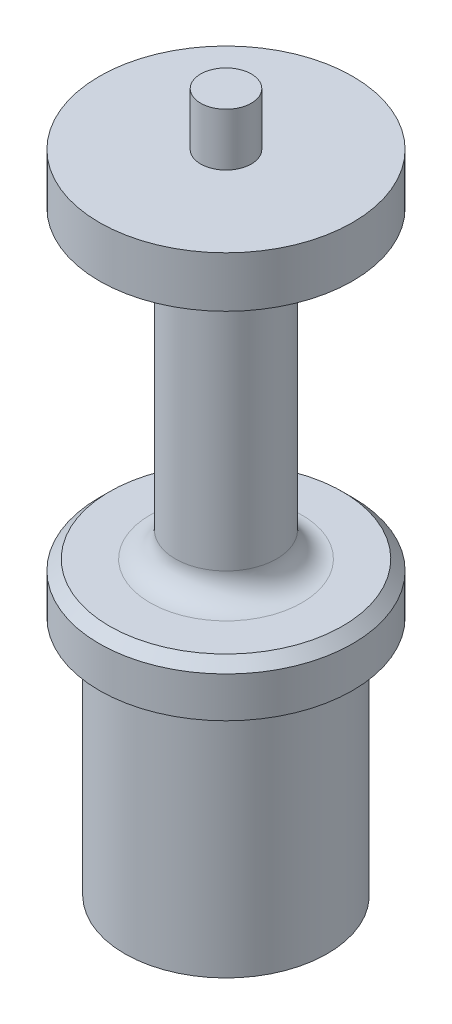
ISO-10303-21;
HEADER;
FILE_DESCRIPTION(('STEP AP214'),'2;1');
FILE_NAME('part.step','',(''),(''),'','','');
FILE_SCHEMA(('AUTOMOTIVE_DESIGN { 1 0 10303 214 1 1 1 1 }'));
ENDSEC;
DATA;
#1=APPLICATION_CONTEXT('core data for automotive mechanical design processes');
#2=APPLICATION_PROTOCOL_DEFINITION('international standard','automotive_design',2000,#1);
#3=PRODUCT_CONTEXT('',#1,'mechanical');
#4=PRODUCT('Part','Part','',(#3));
#5=PRODUCT_RELATED_PRODUCT_CATEGORY('part','',(#4));
#6=PRODUCT_DEFINITION_FORMATION('','',#4);
#7=PRODUCT_DEFINITION_CONTEXT('part definition',#1,'design');
#8=PRODUCT_DEFINITION('design','',#6,#7);
#9=PRODUCT_DEFINITION_SHAPE('','',#8);
#10=(LENGTH_UNIT() NAMED_UNIT(*) SI_UNIT(.MILLI.,.METRE.));
#11=(NAMED_UNIT(*) PLANE_ANGLE_UNIT() SI_UNIT($,.RADIAN.));
#12=(NAMED_UNIT(*) SI_UNIT($,.STERADIAN.) SOLID_ANGLE_UNIT());
#13=UNCERTAINTY_MEASURE_WITH_UNIT(LENGTH_MEASURE(1.E-05),#10,'distance_accuracy_value','');
#14=(GEOMETRIC_REPRESENTATION_CONTEXT(3) GLOBAL_UNCERTAINTY_ASSIGNED_CONTEXT((#13)) GLOBAL_UNIT_ASSIGNED_CONTEXT((#10,
#11,#12)) REPRESENTATION_CONTEXT('',''));
#15=CARTESIAN_POINT('',(0.,0.,0.));
#16=DIRECTION('',(0.,0.,1.));
#17=DIRECTION('',(1.,0.,0.));
#18=AXIS2_PLACEMENT_3D('',#15,#16,#17);
#19=CARTESIAN_POINT('',(0.,80.9625,0.));
#20=DIRECTION('',(0.,-1.,0.));
#21=DIRECTION('',(0.,0.,-1.));
#22=AXIS2_PLACEMENT_3D('',#19,#20,#21);
#23=CYLINDRICAL_SURFACE('',#22,15.875);
#24=CARTESIAN_POINT('',(0.,35.2425,0.));
#25=DIRECTION('',(0.,1.,0.));
#26=DIRECTION('',(0.,0.,1.));
#27=AXIS2_PLACEMENT_3D('',#24,#25,#26);
#28=CIRCLE('',#27,15.875);
#29=CARTESIAN_POINT('',(0.,35.2425,15.875));
#30=VERTEX_POINT('',#29);
#31=EDGE_CURVE('E11',#30,#30,#28,.F.);
#32=ORIENTED_EDGE('',*,*,#31,.T.);
#33=EDGE_LOOP('',(#32));
#34=FACE_BOUND('',#33,.T.);
#35=CARTESIAN_POINT('',(0.,30.1625,0.));
#36=DIRECTION('',(0.,1.,0.));
#37=DIRECTION('',(0.,0.,1.));
#38=AXIS2_PLACEMENT_3D('',#35,#36,#37);
#39=CIRCLE('',#38,15.875);
#40=CARTESIAN_POINT('',(0.,30.1625,15.875));
#41=VERTEX_POINT('',#40);
#42=EDGE_CURVE('E297',#41,#41,#39,.T.);
#43=ORIENTED_EDGE('',*,*,#42,.T.);
#44=EDGE_LOOP('',(#43));
#45=FACE_BOUND('',#44,.T.);
#46=ADVANCED_FACE('F35',(#34,#45),#23,.T.);
#47=CARTESIAN_POINT('',(0.,0.,0.));
#48=DIRECTION('',(0.,1.,0.));
#49=DIRECTION('',(0.,0.,1.));
#50=AXIS2_PLACEMENT_3D('',#47,#48,#49);
#51=PLANE('',#50);
#52=CARTESIAN_POINT('',(0.,0.,0.));
#53=DIRECTION('',(0.,1.,0.));
#54=DIRECTION('',(0.,0.,1.));
#55=AXIS2_PLACEMENT_3D('',#52,#53,#54);
#56=CIRCLE('',#55,12.7);
#57=CARTESIAN_POINT('',(0.,0.,12.7));
#58=VERTEX_POINT('',#57);
#59=EDGE_CURVE('E342',#58,#58,#56,.T.);
#60=ORIENTED_EDGE('',*,*,#59,.F.);
#61=EDGE_LOOP('',(#60));
#62=FACE_BOUND('',#61,.T.);
#63=DIRECTION('',(0.707106781186548,0.,0.707106781186547));
#64=VECTOR('',#63,1.);
#65=CARTESIAN_POINT('',(-4.94974746830584,0.,4.94974746830584));
#66=LINE('',#65,#64);
#67=CARTESIAN_POINT('',(-8.77696292147802,0.,1.12253201513365));
#68=VERTEX_POINT('',#67);
#69=CARTESIAN_POINT('',(-7.,0.,2.89949493661167));
#70=VERTEX_POINT('',#69);
#71=EDGE_CURVE('E50',#68,#70,#66,.T.);
#72=ORIENTED_EDGE('',*,*,#71,.T.);
#73=DIRECTION('',(0.,0.,1.));
#74=VECTOR('',#73,1.);
#75=CARTESIAN_POINT('',(-7.,0.,0.));
#76=LINE('',#75,#74);
#77=CARTESIAN_POINT('',(-7.,0.,5.4125));
#78=VERTEX_POINT('',#77);
#79=EDGE_CURVE('E136',#70,#78,#76,.T.);
#80=ORIENTED_EDGE('',*,*,#79,.T.);
#81=CARTESIAN_POINT('',(-5.4125,0.,5.4125));
#82=DIRECTION('',(0.,-1.,0.));
#83=DIRECTION('',(0.,0.,-1.));
#84=AXIS2_PLACEMENT_3D('',#81,#82,#83);
#85=CIRCLE('',#84,1.5875);
#86=CARTESIAN_POINT('',(-5.4125,0.,7.));
#87=VERTEX_POINT('',#86);
#88=EDGE_CURVE('E291',#87,#78,#85,.T.);
#89=ORIENTED_EDGE('',*,*,#88,.F.);
#90=DIRECTION('',(1.,0.,0.));
#91=VECTOR('',#90,1.);
#92=CARTESIAN_POINT('',(0.,0.,7.));
#93=LINE('',#92,#91);
#94=CARTESIAN_POINT('',(-2.89949493661167,0.,7.));
#95=VERTEX_POINT('',#94);
#96=EDGE_CURVE('E208',#87,#95,#93,.T.);
#97=ORIENTED_EDGE('',*,*,#96,.T.);
#98=DIRECTION('',(0.707106781186548,0.,0.707106781186547));
#99=VECTOR('',#98,1.);
#100=CARTESIAN_POINT('',(-4.94974746830584,0.,4.94974746830584));
#101=LINE('',#100,#99);
#102=CARTESIAN_POINT('',(-1.12253201513365,0.,8.77696292147802));
#103=VERTEX_POINT('',#102);
#104=EDGE_CURVE('E287',#95,#103,#101,.T.);
#105=ORIENTED_EDGE('',*,*,#104,.T.);
#106=CARTESIAN_POINT('',(0.,0.,7.65443090634438));
#107=DIRECTION('',(0.,-1.,0.));
#108=DIRECTION('',(0.,0.,-1.));
#109=AXIS2_PLACEMENT_3D('',#106,#107,#108);
#110=CIRCLE('',#109,1.5875);
#111=CARTESIAN_POINT('',(1.12253201513365,0.,8.77696292147801));
#112=VERTEX_POINT('',#111);
#113=EDGE_CURVE('E284',#112,#103,#110,.T.);
#114=ORIENTED_EDGE('',*,*,#113,.F.);
#115=DIRECTION('',(0.707106781186548,0.,-0.707106781186548));
#116=VECTOR('',#115,1.);
#117=CARTESIAN_POINT('',(4.94974746830583,0.,4.94974746830583));
#118=LINE('',#117,#116);
#119=CARTESIAN_POINT('',(2.89949493661166,0.,7.));
#120=VERTEX_POINT('',#119);
#121=EDGE_CURVE('E281',#112,#120,#118,.T.);
#122=ORIENTED_EDGE('',*,*,#121,.T.);
#123=DIRECTION('',(1.,0.,0.));
#124=VECTOR('',#123,1.);
#125=CARTESIAN_POINT('',(0.,0.,7.));
#126=LINE('',#125,#124);
#127=CARTESIAN_POINT('',(5.4125,0.,7.));
#128=VERTEX_POINT('',#127);
#129=EDGE_CURVE('E278',#120,#128,#126,.T.);
#130=ORIENTED_EDGE('',*,*,#129,.T.);
#131=CARTESIAN_POINT('',(5.4125,0.,5.4125));
#132=DIRECTION('',(0.,-1.,0.));
#133=DIRECTION('',(0.,0.,-1.));
#134=AXIS2_PLACEMENT_3D('',#131,#132,#133);
#135=CIRCLE('',#134,1.5875);
#136=CARTESIAN_POINT('',(7.,0.,5.4125));
#137=VERTEX_POINT('',#136);
#138=EDGE_CURVE('E275',#137,#128,#135,.T.);
#139=ORIENTED_EDGE('',*,*,#138,.F.);
#140=DIRECTION('',(0.,0.,1.));
#141=VECTOR('',#140,1.);
#142=CARTESIAN_POINT('',(7.,0.,0.));
#143=LINE('',#142,#141);
#144=CARTESIAN_POINT('',(7.,0.,2.89949493661167));
#145=VERTEX_POINT('',#144);
#146=EDGE_CURVE('E272',#145,#137,#143,.T.);
#147=ORIENTED_EDGE('',*,*,#146,.F.);
#148=DIRECTION('',(0.707106781186548,0.,-0.707106781186548));
#149=VECTOR('',#148,1.);
#150=CARTESIAN_POINT('',(4.94974746830583,0.,4.94974746830583));
#151=LINE('',#150,#149);
#152=CARTESIAN_POINT('',(8.77696292147802,0.,1.12253201513365));
#153=VERTEX_POINT('',#152);
#154=EDGE_CURVE('E269',#145,#153,#151,.T.);
#155=ORIENTED_EDGE('',*,*,#154,.T.);
#156=CARTESIAN_POINT('',(7.65443090634438,0.,0.));
#157=DIRECTION('',(0.,-1.,0.));
#158=DIRECTION('',(0.,0.,-1.));
#159=AXIS2_PLACEMENT_3D('',#156,#157,#158);
#160=CIRCLE('',#159,1.5875);
#161=CARTESIAN_POINT('',(8.77696292147801,0.,-1.12253201513364));
#162=VERTEX_POINT('',#161);
#163=EDGE_CURVE('E266',#162,#153,#160,.T.);
#164=ORIENTED_EDGE('',*,*,#163,.F.);
#165=DIRECTION('',(0.707106781186548,0.,0.707106781186548));
#166=VECTOR('',#165,1.);
#167=CARTESIAN_POINT('',(4.94974746830583,0.,-4.94974746830583));
#168=LINE('',#167,#166);
#169=CARTESIAN_POINT('',(7.,0.,-2.89949493661165));
#170=VERTEX_POINT('',#169);
#171=EDGE_CURVE('E263',#170,#162,#168,.T.);
#172=ORIENTED_EDGE('',*,*,#171,.F.);
#173=DIRECTION('',(0.,0.,1.));
#174=VECTOR('',#173,1.);
#175=CARTESIAN_POINT('',(7.,0.,0.));
#176=LINE('',#175,#174);
#177=CARTESIAN_POINT('',(7.,0.,-5.4125));
#178=VERTEX_POINT('',#177);
#179=EDGE_CURVE('E260',#178,#170,#176,.T.);
#180=ORIENTED_EDGE('',*,*,#179,.F.);
#181=CARTESIAN_POINT('',(5.4125,0.,-5.4125));
#182=DIRECTION('',(0.,-1.,0.));
#183=DIRECTION('',(0.,0.,-1.));
#184=AXIS2_PLACEMENT_3D('',#181,#182,#183);
#185=CIRCLE('',#184,1.5875);
#186=CARTESIAN_POINT('',(5.4125,0.,-7.));
#187=VERTEX_POINT('',#186);
#188=EDGE_CURVE('E257',#187,#178,#185,.T.);
#189=ORIENTED_EDGE('',*,*,#188,.F.);
#190=DIRECTION('',(1.,0.,0.));
#191=VECTOR('',#190,1.);
#192=CARTESIAN_POINT('',(0.,0.,-7.));
#193=LINE('',#192,#191);
#194=CARTESIAN_POINT('',(2.89949493661166,0.,-7.));
#195=VERTEX_POINT('',#194);
#196=EDGE_CURVE('E254',#195,#187,#193,.T.);
#197=ORIENTED_EDGE('',*,*,#196,.F.);
#198=DIRECTION('',(0.707106781186548,0.,0.707106781186548));
#199=VECTOR('',#198,1.);
#200=CARTESIAN_POINT('',(4.94974746830583,0.,-4.94974746830583));
#201=LINE('',#200,#199);
#202=CARTESIAN_POINT('',(1.12253201513364,0.,-8.77696292147802));
#203=VERTEX_POINT('',#202);
#204=EDGE_CURVE('E251',#203,#195,#201,.T.);
#205=ORIENTED_EDGE('',*,*,#204,.F.);
#206=CARTESIAN_POINT('',(0.,0.,-7.65443090634438));
#207=DIRECTION('',(0.,-1.,0.));
#208=DIRECTION('',(0.,0.,-1.));
#209=AXIS2_PLACEMENT_3D('',#206,#207,#208);
#210=CIRCLE('',#209,1.5875);
#211=CARTESIAN_POINT('',(-1.12253201513365,0.,-8.77696292147802));
#212=VERTEX_POINT('',#211);
#213=EDGE_CURVE('E248',#212,#203,#210,.T.);
#214=ORIENTED_EDGE('',*,*,#213,.F.);
#215=DIRECTION('',(0.707106781186547,0.,-0.707106781186548));
#216=VECTOR('',#215,1.);
#217=CARTESIAN_POINT('',(-4.94974746830583,0.,-4.94974746830583));
#218=LINE('',#217,#216);
#219=CARTESIAN_POINT('',(-2.89949493661167,0.,-7.));
#220=VERTEX_POINT('',#219);
#221=EDGE_CURVE('E245',#220,#212,#218,.T.);
#222=ORIENTED_EDGE('',*,*,#221,.F.);
#223=DIRECTION('',(1.,0.,0.));
#224=VECTOR('',#223,1.);
#225=CARTESIAN_POINT('',(0.,0.,-7.));
#226=LINE('',#225,#224);
#227=CARTESIAN_POINT('',(-5.4125,0.,-7.));
#228=VERTEX_POINT('',#227);
#229=EDGE_CURVE('E242',#228,#220,#226,.T.);
#230=ORIENTED_EDGE('',*,*,#229,.F.);
#231=CARTESIAN_POINT('',(-5.4125,0.,-5.4125));
#232=DIRECTION('',(0.,-1.,0.));
#233=DIRECTION('',(0.,0.,-1.));
#234=AXIS2_PLACEMENT_3D('',#231,#232,#233);
#235=CIRCLE('',#234,1.5875);
#236=CARTESIAN_POINT('',(-7.,0.,-5.4125));
#237=VERTEX_POINT('',#236);
#238=EDGE_CURVE('E239',#237,#228,#235,.T.);
#239=ORIENTED_EDGE('',*,*,#238,.F.);
#240=DIRECTION('',(0.,0.,1.));
#241=VECTOR('',#240,1.);
#242=CARTESIAN_POINT('',(-7.,0.,0.));
#243=LINE('',#242,#241);
#244=CARTESIAN_POINT('',(-7.,0.,-2.89949493661167));
#245=VERTEX_POINT('',#244);
#246=EDGE_CURVE('E236',#237,#245,#243,.T.);
#247=ORIENTED_EDGE('',*,*,#246,.T.);
#248=DIRECTION('',(0.707106781186547,0.,-0.707106781186548));
#249=VECTOR('',#248,1.);
#250=CARTESIAN_POINT('',(-4.94974746830583,0.,-4.94974746830583));
#251=LINE('',#250,#249);
#252=CARTESIAN_POINT('',(-8.77696292147803,0.,-1.12253201513364));
#253=VERTEX_POINT('',#252);
#254=EDGE_CURVE('E233',#253,#245,#251,.T.);
#255=ORIENTED_EDGE('',*,*,#254,.F.);
#256=CARTESIAN_POINT('',(-7.65443090634438,0.,0.));
#257=DIRECTION('',(0.,-1.,0.));
#258=DIRECTION('',(0.,0.,-1.));
#259=AXIS2_PLACEMENT_3D('',#256,#257,#258);
#260=CIRCLE('',#259,1.5875);
#261=EDGE_CURVE('E229',#68,#253,#260,.T.);
#262=ORIENTED_EDGE('',*,*,#261,.F.);
#263=EDGE_LOOP('',(#72,#80,#89,#97,#105,#114,#122,#130,#139,#147,#155,#164,#172,#180,#189,#197,
#205,#214,#222,#230,#239,#247,#255,#262));
#264=FACE_BOUND('',#263,.T.);
#265=ADVANCED_FACE('F378',(#62,#264),#51,.F.);
#266=CARTESIAN_POINT('',(0.,30.1625,0.));
#267=DIRECTION('',(0.,-1.,0.));
#268=DIRECTION('',(0.,0.,-1.));
#269=AXIS2_PLACEMENT_3D('',#266,#267,#268);
#270=CYLINDRICAL_SURFACE('',#269,12.7);
#271=CARTESIAN_POINT('',(0.,30.1625,0.));
#272=DIRECTION('',(0.,1.,0.));
#273=DIRECTION('',(0.,0.,1.));
#274=AXIS2_PLACEMENT_3D('',#271,#272,#273);
#275=CIRCLE('',#274,12.7);
#276=CARTESIAN_POINT('',(0.,30.1625,12.7));
#277=VERTEX_POINT('',#276);
#278=EDGE_CURVE('E345',#277,#277,#275,.T.);
#279=ORIENTED_EDGE('',*,*,#278,.F.);
#280=EDGE_LOOP('',(#279));
#281=FACE_BOUND('',#280,.T.);
#282=ORIENTED_EDGE('',*,*,#59,.T.);
#283=EDGE_LOOP('',(#282));
#284=FACE_BOUND('',#283,.T.);
#285=ADVANCED_FACE('F385',(#281,#284),#270,.T.);
#286=CARTESIAN_POINT('',(0.,30.1625,0.));
#287=DIRECTION('',(0.,1.,0.));
#288=DIRECTION('',(0.,0.,1.));
#289=AXIS2_PLACEMENT_3D('',#286,#287,#288);
#290=PLANE('',#289);
#291=ORIENTED_EDGE('',*,*,#278,.T.);
#292=EDGE_LOOP('',(#291));
#293=FACE_BOUND('',#292,.T.);
#294=ORIENTED_EDGE('',*,*,#42,.F.);
#295=EDGE_LOOP('',(#294));
#296=FACE_BOUND('',#295,.T.);
#297=ADVANCED_FACE('F509',(#293,#296),#290,.F.);
#298=CARTESIAN_POINT('',(-4.94974746830584,11.176,4.94974746830584));
#299=DIRECTION('',(0.707106781186548,0.,-0.707106781186548));
#300=DIRECTION('',(-0.707106781186548,0.,-0.707106781186547));
#301=AXIS2_PLACEMENT_3D('',#298,#299,#300);
#302=PLANE('',#301);
#303=ORIENTED_EDGE('',*,*,#71,.F.);
#304=DIRECTION('',(0.,-1.,0.));
#305=VECTOR('',#304,1.);
#306=CARTESIAN_POINT('',(-8.77696292147802,11.176,1.12253201513365));
#307=LINE('',#306,#305);
#308=CARTESIAN_POINT('',(-8.77696292147802,11.176,1.12253201513365));
#309=VERTEX_POINT('',#308);
#310=EDGE_CURVE('E139',#309,#68,#307,.T.);
#311=ORIENTED_EDGE('',*,*,#310,.F.);
#312=DIRECTION('',(0.707106781186548,0.,0.707106781186547));
#313=VECTOR('',#312,1.);
#314=CARTESIAN_POINT('',(-4.94974746830584,11.176,4.94974746830584));
#315=LINE('',#314,#313);
#316=CARTESIAN_POINT('',(-7.,11.176,2.89949493661167));
#317=VERTEX_POINT('',#316);
#318=EDGE_CURVE('E294',#309,#317,#315,.T.);
#319=ORIENTED_EDGE('',*,*,#318,.T.);
#320=DIRECTION('',(0.,-1.,0.));
#321=VECTOR('',#320,1.);
#322=CARTESIAN_POINT('',(-7.,11.176,2.89949493661167));
#323=LINE('',#322,#321);
#324=EDGE_CURVE('E295',#317,#70,#323,.T.);
#325=ORIENTED_EDGE('',*,*,#324,.T.);
#326=EDGE_LOOP('',(#303,#311,#319,#325));
#327=FACE_BOUND('',#326,.T.);
#328=ADVANCED_FACE('F500',(#327),#302,.T.);
#329=CARTESIAN_POINT('',(-7.,11.176,0.));
#330=DIRECTION('',(1.,0.,0.));
#331=DIRECTION('',(0.,0.,-1.));
#332=AXIS2_PLACEMENT_3D('',#329,#330,#331);
#333=PLANE('',#332);
#334=ORIENTED_EDGE('',*,*,#79,.F.);
#335=ORIENTED_EDGE('',*,*,#324,.F.);
#336=DIRECTION('',(0.,0.,1.));
#337=VECTOR('',#336,1.);
#338=CARTESIAN_POINT('',(-7.,11.176,0.));
#339=LINE('',#338,#337);
#340=CARTESIAN_POINT('',(-7.,11.176,5.4125));
#341=VERTEX_POINT('',#340);
#342=EDGE_CURVE('E59',#317,#341,#339,.T.);
#343=ORIENTED_EDGE('',*,*,#342,.T.);
#344=DIRECTION('',(0.,-1.,0.));
#345=VECTOR('',#344,1.);
#346=CARTESIAN_POINT('',(-7.,11.176,5.4125));
#347=LINE('',#346,#345);
#348=EDGE_CURVE('E213',#341,#78,#347,.T.);
#349=ORIENTED_EDGE('',*,*,#348,.T.);
#350=EDGE_LOOP('',(#334,#335,#343,#349));
#351=FACE_BOUND('',#350,.T.);
#352=ADVANCED_FACE('F501',(#351),#333,.T.);
#353=CARTESIAN_POINT('',(-5.4125,11.176,5.4125));
#354=DIRECTION('',(0.,-1.,0.));
#355=DIRECTION('',(0.,0.,-1.));
#356=AXIS2_PLACEMENT_3D('',#353,#354,#355);
#357=CYLINDRICAL_SURFACE('',#356,1.5875);
#358=ORIENTED_EDGE('',*,*,#88,.T.);
#359=ORIENTED_EDGE('',*,*,#348,.F.);
#360=CARTESIAN_POINT('',(-5.4125,11.176,5.4125));
#361=DIRECTION('',(0.,-1.,0.));
#362=DIRECTION('',(0.,0.,-1.));
#363=AXIS2_PLACEMENT_3D('',#360,#361,#362);
#364=CIRCLE('',#363,1.5875);
#365=CARTESIAN_POINT('',(-5.4125,11.176,7.));
#366=VERTEX_POINT('',#365);
#367=EDGE_CURVE('E218',#366,#341,#364,.T.);
#368=ORIENTED_EDGE('',*,*,#367,.F.);
#369=DIRECTION('',(0.,-1.,0.));
#370=VECTOR('',#369,1.);
#371=CARTESIAN_POINT('',(-5.4125,11.176,7.));
#372=LINE('',#371,#370);
#373=EDGE_CURVE('E202',#366,#87,#372,.T.);
#374=ORIENTED_EDGE('',*,*,#373,.T.);
#375=EDGE_LOOP('',(#358,#359,#368,#374));
#376=FACE_BOUND('',#375,.T.);
#377=ADVANCED_FACE('F223',(#376),#357,.F.);
#378=CARTESIAN_POINT('',(0.,11.176,7.));
#379=DIRECTION('',(0.,0.,-1.));
#380=DIRECTION('',(-1.,0.,0.));
#381=AXIS2_PLACEMENT_3D('',#378,#379,#380);
#382=PLANE('',#381);
#383=ORIENTED_EDGE('',*,*,#96,.F.);
#384=ORIENTED_EDGE('',*,*,#373,.F.);
#385=DIRECTION('',(1.,0.,0.));
#386=VECTOR('',#385,1.);
#387=CARTESIAN_POINT('',(0.,11.176,7.));
#388=LINE('',#387,#386);
#389=CARTESIAN_POINT('',(-2.89949493661167,11.176,7.));
#390=VERTEX_POINT('',#389);
#391=EDGE_CURVE('E205',#366,#390,#388,.T.);
#392=ORIENTED_EDGE('',*,*,#391,.T.);
#393=DIRECTION('',(0.,-1.,0.));
#394=VECTOR('',#393,1.);
#395=CARTESIAN_POINT('',(-2.89949493661167,11.176,7.));
#396=LINE('',#395,#394);
#397=EDGE_CURVE('E214',#390,#95,#396,.T.);
#398=ORIENTED_EDGE('',*,*,#397,.T.);
#399=EDGE_LOOP('',(#383,#384,#392,#398));
#400=FACE_BOUND('',#399,.T.);
#401=ADVANCED_FACE('F204',(#400),#382,.T.);
#402=CARTESIAN_POINT('',(-4.94974746830584,11.176,4.94974746830584));
#403=DIRECTION('',(0.707106781186548,0.,-0.707106781186548));
#404=DIRECTION('',(-0.707106781186548,0.,-0.707106781186547));
#405=AXIS2_PLACEMENT_3D('',#402,#403,#404);
#406=PLANE('',#405);
#407=ORIENTED_EDGE('',*,*,#104,.F.);
#408=ORIENTED_EDGE('',*,*,#397,.F.);
#409=DIRECTION('',(0.707106781186548,0.,0.707106781186547));
#410=VECTOR('',#409,1.);
#411=CARTESIAN_POINT('',(-4.94974746830584,11.176,4.94974746830584));
#412=LINE('',#411,#410);
#413=CARTESIAN_POINT('',(-1.12253201513365,11.176,8.77696292147802));
#414=VERTEX_POINT('',#413);
#415=EDGE_CURVE('E220',#390,#414,#412,.T.);
#416=ORIENTED_EDGE('',*,*,#415,.T.);
#417=DIRECTION('',(0.,-1.,0.));
#418=VECTOR('',#417,1.);
#419=CARTESIAN_POINT('',(-1.12253201513365,11.176,8.77696292147802));
#420=LINE('',#419,#418);
#421=EDGE_CURVE('E300',#414,#103,#420,.T.);
#422=ORIENTED_EDGE('',*,*,#421,.T.);
#423=EDGE_LOOP('',(#407,#408,#416,#422));
#424=FACE_BOUND('',#423,.T.);
#425=ADVANCED_FACE('F476',(#424),#406,.T.);
#426=CARTESIAN_POINT('',(0.,11.176,7.65443090634438));
#427=DIRECTION('',(0.,-1.,0.));
#428=DIRECTION('',(0.,0.,-1.));
#429=AXIS2_PLACEMENT_3D('',#426,#427,#428);
#430=CYLINDRICAL_SURFACE('',#429,1.5875);
#431=ORIENTED_EDGE('',*,*,#113,.T.);
#432=ORIENTED_EDGE('',*,*,#421,.F.);
#433=CARTESIAN_POINT('',(0.,11.176,7.65443090634438));
#434=DIRECTION('',(0.,-1.,0.));
#435=DIRECTION('',(0.,0.,-1.));
#436=AXIS2_PLACEMENT_3D('',#433,#434,#435);
#437=CIRCLE('',#436,1.5875);
#438=CARTESIAN_POINT('',(1.12253201513365,11.176,8.77696292147801));
#439=VERTEX_POINT('',#438);
#440=EDGE_CURVE('E472',#439,#414,#437,.T.);
#441=ORIENTED_EDGE('',*,*,#440,.F.);
#442=DIRECTION('',(0.,-1.,0.));
#443=VECTOR('',#442,1.);
#444=CARTESIAN_POINT('',(1.12253201513365,11.176,8.77696292147801));
#445=LINE('',#444,#443);
#446=EDGE_CURVE('E302',#439,#112,#445,.T.);
#447=ORIENTED_EDGE('',*,*,#446,.T.);
#448=EDGE_LOOP('',(#431,#432,#441,#447));
#449=FACE_BOUND('',#448,.T.);
#450=ADVANCED_FACE('F479',(#449),#430,.F.);
#451=CARTESIAN_POINT('',(4.94974746830583,11.176,4.94974746830583));
#452=DIRECTION('',(-0.707106781186548,0.,-0.707106781186548));
#453=DIRECTION('',(-0.707106781186548,0.,0.707106781186548));
#454=AXIS2_PLACEMENT_3D('',#451,#452,#453);
#455=PLANE('',#454);
#456=ORIENTED_EDGE('',*,*,#121,.F.);
#457=ORIENTED_EDGE('',*,*,#446,.F.);
#458=DIRECTION('',(0.707106781186548,0.,-0.707106781186548));
#459=VECTOR('',#458,1.);
#460=CARTESIAN_POINT('',(4.94974746830583,11.176,4.94974746830583));
#461=LINE('',#460,#459);
#462=CARTESIAN_POINT('',(2.89949493661166,11.176,7.));
#463=VERTEX_POINT('',#462);
#464=EDGE_CURVE('E470',#439,#463,#461,.T.);
#465=ORIENTED_EDGE('',*,*,#464,.T.);
#466=DIRECTION('',(0.,-1.,0.));
#467=VECTOR('',#466,1.);
#468=CARTESIAN_POINT('',(2.89949493661166,11.176,7.));
#469=LINE('',#468,#467);
#470=EDGE_CURVE('E304',#463,#120,#469,.T.);
#471=ORIENTED_EDGE('',*,*,#470,.T.);
#472=EDGE_LOOP('',(#456,#457,#465,#471));
#473=FACE_BOUND('',#472,.T.);
#474=ADVANCED_FACE('F486',(#473),#455,.T.);
#475=CARTESIAN_POINT('',(0.,11.176,7.));
#476=DIRECTION('',(0.,0.,-1.));
#477=DIRECTION('',(-1.,0.,0.));
#478=AXIS2_PLACEMENT_3D('',#475,#476,#477);
#479=PLANE('',#478);
#480=ORIENTED_EDGE('',*,*,#129,.F.);
#481=ORIENTED_EDGE('',*,*,#470,.F.);
#482=DIRECTION('',(1.,0.,0.));
#483=VECTOR('',#482,1.);
#484=CARTESIAN_POINT('',(0.,11.176,7.));
#485=LINE('',#484,#483);
#486=CARTESIAN_POINT('',(5.4125,11.176,7.));
#487=VERTEX_POINT('',#486);
#488=EDGE_CURVE('E468',#463,#487,#485,.T.);
#489=ORIENTED_EDGE('',*,*,#488,.T.);
#490=DIRECTION('',(0.,-1.,0.));
#491=VECTOR('',#490,1.);
#492=CARTESIAN_POINT('',(5.4125,11.176,7.));
#493=LINE('',#492,#491);
#494=EDGE_CURVE('E306',#487,#128,#493,.T.);
#495=ORIENTED_EDGE('',*,*,#494,.T.);
#496=EDGE_LOOP('',(#480,#481,#489,#495));
#497=FACE_BOUND('',#496,.T.);
#498=ADVANCED_FACE('F489',(#497),#479,.T.);
#499=CARTESIAN_POINT('',(5.4125,11.176,5.4125));
#500=DIRECTION('',(0.,-1.,0.));
#501=DIRECTION('',(0.,0.,-1.));
#502=AXIS2_PLACEMENT_3D('',#499,#500,#501);
#503=CYLINDRICAL_SURFACE('',#502,1.5875);
#504=ORIENTED_EDGE('',*,*,#138,.T.);
#505=ORIENTED_EDGE('',*,*,#494,.F.);
#506=CARTESIAN_POINT('',(5.4125,11.176,5.4125));
#507=DIRECTION('',(0.,-1.,0.));
#508=DIRECTION('',(0.,0.,-1.));
#509=AXIS2_PLACEMENT_3D('',#506,#507,#508);
#510=CIRCLE('',#509,1.5875);
#511=CARTESIAN_POINT('',(7.,11.176,5.4125));
#512=VERTEX_POINT('',#511);
#513=EDGE_CURVE('E465',#512,#487,#510,.T.);
#514=ORIENTED_EDGE('',*,*,#513,.F.);
#515=DIRECTION('',(0.,-1.,0.));
#516=VECTOR('',#515,1.);
#517=CARTESIAN_POINT('',(7.,11.176,5.4125));
#518=LINE('',#517,#516);
#519=EDGE_CURVE('E308',#512,#137,#518,.T.);
#520=ORIENTED_EDGE('',*,*,#519,.T.);
#521=EDGE_LOOP('',(#504,#505,#514,#520));
#522=FACE_BOUND('',#521,.T.);
#523=ADVANCED_FACE('F524',(#522),#503,.F.);
#524=CARTESIAN_POINT('',(7.,11.176,0.));
#525=DIRECTION('',(1.,0.,0.));
#526=DIRECTION('',(0.,0.,-1.));
#527=AXIS2_PLACEMENT_3D('',#524,#525,#526);
#528=PLANE('',#527);
#529=ORIENTED_EDGE('',*,*,#146,.T.);
#530=ORIENTED_EDGE('',*,*,#519,.F.);
#531=DIRECTION('',(0.,0.,1.));
#532=VECTOR('',#531,1.);
#533=CARTESIAN_POINT('',(7.,11.176,0.));
#534=LINE('',#533,#532);
#535=CARTESIAN_POINT('',(7.,11.176,2.89949493661167));
#536=VERTEX_POINT('',#535);
#537=EDGE_CURVE('E462',#536,#512,#534,.T.);
#538=ORIENTED_EDGE('',*,*,#537,.F.);
#539=DIRECTION('',(0.,-1.,0.));
#540=VECTOR('',#539,1.);
#541=CARTESIAN_POINT('',(7.,11.176,2.89949493661167));
#542=LINE('',#541,#540);
#543=EDGE_CURVE('E310',#536,#145,#542,.T.);
#544=ORIENTED_EDGE('',*,*,#543,.T.);
#545=EDGE_LOOP('',(#529,#530,#538,#544));
#546=FACE_BOUND('',#545,.T.);
#547=ADVANCED_FACE('F527',(#546),#528,.F.);
#548=CARTESIAN_POINT('',(4.94974746830583,11.176,4.94974746830583));
#549=DIRECTION('',(-0.707106781186548,0.,-0.707106781186548));
#550=DIRECTION('',(-0.707106781186548,0.,0.707106781186548));
#551=AXIS2_PLACEMENT_3D('',#548,#549,#550);
#552=PLANE('',#551);
#553=ORIENTED_EDGE('',*,*,#154,.F.);
#554=ORIENTED_EDGE('',*,*,#543,.F.);
#555=DIRECTION('',(0.707106781186548,0.,-0.707106781186548));
#556=VECTOR('',#555,1.);
#557=CARTESIAN_POINT('',(4.94974746830583,11.176,4.94974746830583));
#558=LINE('',#557,#556);
#559=CARTESIAN_POINT('',(8.77696292147802,11.176,1.12253201513365));
#560=VERTEX_POINT('',#559);
#561=EDGE_CURVE('E460',#536,#560,#558,.T.);
#562=ORIENTED_EDGE('',*,*,#561,.T.);
#563=DIRECTION('',(0.,-1.,0.));
#564=VECTOR('',#563,1.);
#565=CARTESIAN_POINT('',(8.77696292147802,11.176,1.12253201513365));
#566=LINE('',#565,#564);
#567=EDGE_CURVE('E312',#560,#153,#566,.T.);
#568=ORIENTED_EDGE('',*,*,#567,.T.);
#569=EDGE_LOOP('',(#553,#554,#562,#568));
#570=FACE_BOUND('',#569,.T.);
#571=ADVANCED_FACE('F531',(#570),#552,.T.);
#572=CARTESIAN_POINT('',(7.65443090634438,11.176,0.));
#573=DIRECTION('',(0.,-1.,0.));
#574=DIRECTION('',(0.,0.,-1.));
#575=AXIS2_PLACEMENT_3D('',#572,#573,#574);
#576=CYLINDRICAL_SURFACE('',#575,1.5875);
#577=ORIENTED_EDGE('',*,*,#163,.T.);
#578=ORIENTED_EDGE('',*,*,#567,.F.);
#579=CARTESIAN_POINT('',(7.65443090634438,11.176,0.));
#580=DIRECTION('',(0.,-1.,0.));
#581=DIRECTION('',(0.,0.,-1.));
#582=AXIS2_PLACEMENT_3D('',#579,#580,#581);
#583=CIRCLE('',#582,1.5875);
#584=CARTESIAN_POINT('',(8.77696292147801,11.176,-1.12253201513364));
#585=VERTEX_POINT('',#584);
#586=EDGE_CURVE('E457',#585,#560,#583,.T.);
#587=ORIENTED_EDGE('',*,*,#586,.F.);
#588=DIRECTION('',(0.,-1.,0.));
#589=VECTOR('',#588,1.);
#590=CARTESIAN_POINT('',(8.77696292147801,11.176,-1.12253201513364));
#591=LINE('',#590,#589);
#592=EDGE_CURVE('E314',#585,#162,#591,.T.);
#593=ORIENTED_EDGE('',*,*,#592,.T.);
#594=EDGE_LOOP('',(#577,#578,#587,#593));
#595=FACE_BOUND('',#594,.T.);
#596=ADVANCED_FACE('F535',(#595),#576,.F.);
#597=CARTESIAN_POINT('',(4.94974746830583,11.176,-4.94974746830583));
#598=DIRECTION('',(0.707106781186548,0.,-0.707106781186548));
#599=DIRECTION('',(-0.707106781186548,0.,-0.707106781186548));
#600=AXIS2_PLACEMENT_3D('',#597,#598,#599);
#601=PLANE('',#600);
#602=ORIENTED_EDGE('',*,*,#171,.T.);
#603=ORIENTED_EDGE('',*,*,#592,.F.);
#604=DIRECTION('',(0.707106781186548,0.,0.707106781186548));
#605=VECTOR('',#604,1.);
#606=CARTESIAN_POINT('',(4.94974746830583,11.176,-4.94974746830583));
#607=LINE('',#606,#605);
#608=CARTESIAN_POINT('',(7.,11.176,-2.89949493661165));
#609=VERTEX_POINT('',#608);
#610=EDGE_CURVE('E454',#609,#585,#607,.T.);
#611=ORIENTED_EDGE('',*,*,#610,.F.);
#612=DIRECTION('',(0.,-1.,0.));
#613=VECTOR('',#612,1.);
#614=CARTESIAN_POINT('',(7.,11.176,-2.89949493661165));
#615=LINE('',#614,#613);
#616=EDGE_CURVE('E316',#609,#170,#615,.T.);
#617=ORIENTED_EDGE('',*,*,#616,.T.);
#618=EDGE_LOOP('',(#602,#603,#611,#617));
#619=FACE_BOUND('',#618,.T.);
#620=ADVANCED_FACE('F539',(#619),#601,.F.);
#621=CARTESIAN_POINT('',(7.,11.176,0.));
#622=DIRECTION('',(1.,0.,0.));
#623=DIRECTION('',(0.,0.,-1.));
#624=AXIS2_PLACEMENT_3D('',#621,#622,#623);
#625=PLANE('',#624);
#626=ORIENTED_EDGE('',*,*,#179,.T.);
#627=ORIENTED_EDGE('',*,*,#616,.F.);
#628=DIRECTION('',(0.,0.,1.));
#629=VECTOR('',#628,1.);
#630=CARTESIAN_POINT('',(7.,11.176,0.));
#631=LINE('',#630,#629);
#632=CARTESIAN_POINT('',(7.,11.176,-5.4125));
#633=VERTEX_POINT('',#632);
#634=EDGE_CURVE('E451',#633,#609,#631,.T.);
#635=ORIENTED_EDGE('',*,*,#634,.F.);
#636=DIRECTION('',(0.,-1.,0.));
#637=VECTOR('',#636,1.);
#638=CARTESIAN_POINT('',(7.,11.176,-5.4125));
#639=LINE('',#638,#637);
#640=EDGE_CURVE('E318',#633,#178,#639,.T.);
#641=ORIENTED_EDGE('',*,*,#640,.T.);
#642=EDGE_LOOP('',(#626,#627,#635,#641));
#643=FACE_BOUND('',#642,.T.);
#644=ADVANCED_FACE('F543',(#643),#625,.F.);
#645=CARTESIAN_POINT('',(5.4125,11.176,-5.4125));
#646=DIRECTION('',(0.,-1.,0.));
#647=DIRECTION('',(0.,0.,-1.));
#648=AXIS2_PLACEMENT_3D('',#645,#646,#647);
#649=CYLINDRICAL_SURFACE('',#648,1.5875);
#650=ORIENTED_EDGE('',*,*,#188,.T.);
#651=ORIENTED_EDGE('',*,*,#640,.F.);
#652=CARTESIAN_POINT('',(5.4125,11.176,-5.4125));
#653=DIRECTION('',(0.,-1.,0.));
#654=DIRECTION('',(0.,0.,-1.));
#655=AXIS2_PLACEMENT_3D('',#652,#653,#654);
#656=CIRCLE('',#655,1.5875);
#657=CARTESIAN_POINT('',(5.4125,11.176,-7.));
#658=VERTEX_POINT('',#657);
#659=EDGE_CURVE('E448',#658,#633,#656,.T.);
#660=ORIENTED_EDGE('',*,*,#659,.F.);
#661=DIRECTION('',(0.,-1.,0.));
#662=VECTOR('',#661,1.);
#663=CARTESIAN_POINT('',(5.4125,11.176,-7.));
#664=LINE('',#663,#662);
#665=EDGE_CURVE('E320',#658,#187,#664,.T.);
#666=ORIENTED_EDGE('',*,*,#665,.T.);
#667=EDGE_LOOP('',(#650,#651,#660,#666));
#668=FACE_BOUND('',#667,.T.);
#669=ADVANCED_FACE('F547',(#668),#649,.F.);
#670=CARTESIAN_POINT('',(0.,11.176,-7.));
#671=DIRECTION('',(0.,0.,-1.));
#672=DIRECTION('',(-1.,0.,0.));
#673=AXIS2_PLACEMENT_3D('',#670,#671,#672);
#674=PLANE('',#673);
#675=ORIENTED_EDGE('',*,*,#196,.T.);
#676=ORIENTED_EDGE('',*,*,#665,.F.);
#677=DIRECTION('',(1.,0.,0.));
#678=VECTOR('',#677,1.);
#679=CARTESIAN_POINT('',(0.,11.176,-7.));
#680=LINE('',#679,#678);
#681=CARTESIAN_POINT('',(2.89949493661166,11.176,-7.));
#682=VERTEX_POINT('',#681);
#683=EDGE_CURVE('E445',#682,#658,#680,.T.);
#684=ORIENTED_EDGE('',*,*,#683,.F.);
#685=DIRECTION('',(0.,-1.,0.));
#686=VECTOR('',#685,1.);
#687=CARTESIAN_POINT('',(2.89949493661166,11.176,-7.));
#688=LINE('',#687,#686);
#689=EDGE_CURVE('E322',#682,#195,#688,.T.);
#690=ORIENTED_EDGE('',*,*,#689,.T.);
#691=EDGE_LOOP('',(#675,#676,#684,#690));
#692=FACE_BOUND('',#691,.T.);
#693=ADVANCED_FACE('F551',(#692),#674,.F.);
#694=CARTESIAN_POINT('',(4.94974746830583,11.176,-4.94974746830583));
#695=DIRECTION('',(0.707106781186548,0.,-0.707106781186548));
#696=DIRECTION('',(-0.707106781186548,0.,-0.707106781186548));
#697=AXIS2_PLACEMENT_3D('',#694,#695,#696);
#698=PLANE('',#697);
#699=ORIENTED_EDGE('',*,*,#204,.T.);
#700=ORIENTED_EDGE('',*,*,#689,.F.);
#701=DIRECTION('',(0.707106781186548,0.,0.707106781186548));
#702=VECTOR('',#701,1.);
#703=CARTESIAN_POINT('',(4.94974746830583,11.176,-4.94974746830583));
#704=LINE('',#703,#702);
#705=CARTESIAN_POINT('',(1.12253201513364,11.176,-8.77696292147802));
#706=VERTEX_POINT('',#705);
#707=EDGE_CURVE('E442',#706,#682,#704,.T.);
#708=ORIENTED_EDGE('',*,*,#707,.F.);
#709=DIRECTION('',(0.,-1.,0.));
#710=VECTOR('',#709,1.);
#711=CARTESIAN_POINT('',(1.12253201513364,11.176,-8.77696292147802));
#712=LINE('',#711,#710);
#713=EDGE_CURVE('E324',#706,#203,#712,.T.);
#714=ORIENTED_EDGE('',*,*,#713,.T.);
#715=EDGE_LOOP('',(#699,#700,#708,#714));
#716=FACE_BOUND('',#715,.T.);
#717=ADVANCED_FACE('F555',(#716),#698,.F.);
#718=CARTESIAN_POINT('',(0.,11.176,-7.65443090634438));
#719=DIRECTION('',(0.,-1.,0.));
#720=DIRECTION('',(0.,0.,-1.));
#721=AXIS2_PLACEMENT_3D('',#718,#719,#720);
#722=CYLINDRICAL_SURFACE('',#721,1.5875);
#723=ORIENTED_EDGE('',*,*,#213,.T.);
#724=ORIENTED_EDGE('',*,*,#713,.F.);
#725=CARTESIAN_POINT('',(0.,11.176,-7.65443090634438));
#726=DIRECTION('',(0.,-1.,0.));
#727=DIRECTION('',(0.,0.,-1.));
#728=AXIS2_PLACEMENT_3D('',#725,#726,#727);
#729=CIRCLE('',#728,1.5875);
#730=CARTESIAN_POINT('',(-1.12253201513365,11.176,-8.77696292147802));
#731=VERTEX_POINT('',#730);
#732=EDGE_CURVE('E439',#731,#706,#729,.T.);
#733=ORIENTED_EDGE('',*,*,#732,.F.);
#734=DIRECTION('',(0.,-1.,0.));
#735=VECTOR('',#734,1.);
#736=CARTESIAN_POINT('',(-1.12253201513365,11.176,-8.77696292147802));
#737=LINE('',#736,#735);
#738=EDGE_CURVE('E326',#731,#212,#737,.T.);
#739=ORIENTED_EDGE('',*,*,#738,.T.);
#740=EDGE_LOOP('',(#723,#724,#733,#739));
#741=FACE_BOUND('',#740,.T.);
#742=ADVANCED_FACE('F559',(#741),#722,.F.);
#743=CARTESIAN_POINT('',(-4.94974746830583,11.176,-4.94974746830583));
#744=DIRECTION('',(-0.707106781186548,0.,-0.707106781186548));
#745=DIRECTION('',(-0.707106781186547,0.,0.707106781186548));
#746=AXIS2_PLACEMENT_3D('',#743,#744,#745);
#747=PLANE('',#746);
#748=ORIENTED_EDGE('',*,*,#221,.T.);
#749=ORIENTED_EDGE('',*,*,#738,.F.);
#750=DIRECTION('',(0.707106781186547,0.,-0.707106781186548));
#751=VECTOR('',#750,1.);
#752=CARTESIAN_POINT('',(-4.94974746830583,11.176,-4.94974746830583));
#753=LINE('',#752,#751);
#754=CARTESIAN_POINT('',(-2.89949493661167,11.176,-7.));
#755=VERTEX_POINT('',#754);
#756=EDGE_CURVE('E436',#755,#731,#753,.T.);
#757=ORIENTED_EDGE('',*,*,#756,.F.);
#758=DIRECTION('',(0.,-1.,0.));
#759=VECTOR('',#758,1.);
#760=CARTESIAN_POINT('',(-2.89949493661167,11.176,-7.));
#761=LINE('',#760,#759);
#762=EDGE_CURVE('E328',#755,#220,#761,.T.);
#763=ORIENTED_EDGE('',*,*,#762,.T.);
#764=EDGE_LOOP('',(#748,#749,#757,#763));
#765=FACE_BOUND('',#764,.T.);
#766=ADVANCED_FACE('F563',(#765),#747,.F.);
#767=CARTESIAN_POINT('',(0.,11.176,-7.));
#768=DIRECTION('',(0.,0.,-1.));
#769=DIRECTION('',(-1.,0.,0.));
#770=AXIS2_PLACEMENT_3D('',#767,#768,#769);
#771=PLANE('',#770);
#772=ORIENTED_EDGE('',*,*,#229,.T.);
#773=ORIENTED_EDGE('',*,*,#762,.F.);
#774=DIRECTION('',(1.,0.,0.));
#775=VECTOR('',#774,1.);
#776=CARTESIAN_POINT('',(0.,11.176,-7.));
#777=LINE('',#776,#775);
#778=CARTESIAN_POINT('',(-5.4125,11.176,-7.));
#779=VERTEX_POINT('',#778);
#780=EDGE_CURVE('E433',#779,#755,#777,.T.);
#781=ORIENTED_EDGE('',*,*,#780,.F.);
#782=DIRECTION('',(0.,-1.,0.));
#783=VECTOR('',#782,1.);
#784=CARTESIAN_POINT('',(-5.4125,11.176,-7.));
#785=LINE('',#784,#783);
#786=EDGE_CURVE('E330',#779,#228,#785,.T.);
#787=ORIENTED_EDGE('',*,*,#786,.T.);
#788=EDGE_LOOP('',(#772,#773,#781,#787));
#789=FACE_BOUND('',#788,.T.);
#790=ADVANCED_FACE('F567',(#789),#771,.F.);
#791=CARTESIAN_POINT('',(-5.4125,11.176,-5.4125));
#792=DIRECTION('',(0.,-1.,0.));
#793=DIRECTION('',(0.,0.,-1.));
#794=AXIS2_PLACEMENT_3D('',#791,#792,#793);
#795=CYLINDRICAL_SURFACE('',#794,1.5875);
#796=ORIENTED_EDGE('',*,*,#238,.T.);
#797=ORIENTED_EDGE('',*,*,#786,.F.);
#798=CARTESIAN_POINT('',(-5.4125,11.176,-5.4125));
#799=DIRECTION('',(0.,-1.,0.));
#800=DIRECTION('',(0.,0.,-1.));
#801=AXIS2_PLACEMENT_3D('',#798,#799,#800);
#802=CIRCLE('',#801,1.5875);
#803=CARTESIAN_POINT('',(-7.,11.176,-5.4125));
#804=VERTEX_POINT('',#803);
#805=EDGE_CURVE('E430',#804,#779,#802,.T.);
#806=ORIENTED_EDGE('',*,*,#805,.F.);
#807=DIRECTION('',(0.,-1.,0.));
#808=VECTOR('',#807,1.);
#809=CARTESIAN_POINT('',(-7.,11.176,-5.4125));
#810=LINE('',#809,#808);
#811=EDGE_CURVE('E332',#804,#237,#810,.T.);
#812=ORIENTED_EDGE('',*,*,#811,.T.);
#813=EDGE_LOOP('',(#796,#797,#806,#812));
#814=FACE_BOUND('',#813,.T.);
#815=ADVANCED_FACE('F571',(#814),#795,.F.);
#816=CARTESIAN_POINT('',(-7.,11.176,0.));
#817=DIRECTION('',(1.,0.,0.));
#818=DIRECTION('',(0.,0.,-1.));
#819=AXIS2_PLACEMENT_3D('',#816,#817,#818);
#820=PLANE('',#819);
#821=ORIENTED_EDGE('',*,*,#246,.F.);
#822=ORIENTED_EDGE('',*,*,#811,.F.);
#823=DIRECTION('',(0.,0.,1.));
#824=VECTOR('',#823,1.);
#825=CARTESIAN_POINT('',(-7.,11.176,0.));
#826=LINE('',#825,#824);
#827=CARTESIAN_POINT('',(-7.,11.176,-2.89949493661167));
#828=VERTEX_POINT('',#827);
#829=EDGE_CURVE('E428',#804,#828,#826,.T.);
#830=ORIENTED_EDGE('',*,*,#829,.T.);
#831=DIRECTION('',(0.,-1.,0.));
#832=VECTOR('',#831,1.);
#833=CARTESIAN_POINT('',(-7.,11.176,-2.89949493661167));
#834=LINE('',#833,#832);
#835=EDGE_CURVE('E334',#828,#245,#834,.T.);
#836=ORIENTED_EDGE('',*,*,#835,.T.);
#837=EDGE_LOOP('',(#821,#822,#830,#836));
#838=FACE_BOUND('',#837,.T.);
#839=ADVANCED_FACE('F575',(#838),#820,.T.);
#840=CARTESIAN_POINT('',(-4.94974746830583,11.176,-4.94974746830583));
#841=DIRECTION('',(-0.707106781186548,0.,-0.707106781186548));
#842=DIRECTION('',(-0.707106781186547,0.,0.707106781186548));
#843=AXIS2_PLACEMENT_3D('',#840,#841,#842);
#844=PLANE('',#843);
#845=ORIENTED_EDGE('',*,*,#254,.T.);
#846=ORIENTED_EDGE('',*,*,#835,.F.);
#847=DIRECTION('',(0.707106781186547,0.,-0.707106781186548));
#848=VECTOR('',#847,1.);
#849=CARTESIAN_POINT('',(-4.94974746830583,11.176,-4.94974746830583));
#850=LINE('',#849,#848);
#851=CARTESIAN_POINT('',(-8.77696292147803,11.176,-1.12253201513364));
#852=VERTEX_POINT('',#851);
#853=EDGE_CURVE('E425',#852,#828,#850,.T.);
#854=ORIENTED_EDGE('',*,*,#853,.F.);
#855=DIRECTION('',(0.,-1.,0.));
#856=VECTOR('',#855,1.);
#857=CARTESIAN_POINT('',(-8.77696292147803,11.176,-1.12253201513364));
#858=LINE('',#857,#856);
#859=EDGE_CURVE('E336',#852,#253,#858,.T.);
#860=ORIENTED_EDGE('',*,*,#859,.T.);
#861=EDGE_LOOP('',(#845,#846,#854,#860));
#862=FACE_BOUND('',#861,.T.);
#863=ADVANCED_FACE('F579',(#862),#844,.F.);
#864=CARTESIAN_POINT('',(-7.65443090634438,11.176,0.));
#865=DIRECTION('',(0.,-1.,0.));
#866=DIRECTION('',(0.,0.,-1.));
#867=AXIS2_PLACEMENT_3D('',#864,#865,#866);
#868=CYLINDRICAL_SURFACE('',#867,1.5875);
#869=ORIENTED_EDGE('',*,*,#261,.T.);
#870=ORIENTED_EDGE('',*,*,#859,.F.);
#871=CARTESIAN_POINT('',(-7.65443090634438,11.176,0.));
#872=DIRECTION('',(0.,-1.,0.));
#873=DIRECTION('',(0.,0.,-1.));
#874=AXIS2_PLACEMENT_3D('',#871,#872,#873);
#875=CIRCLE('',#874,1.5875);
#876=EDGE_CURVE('E422',#309,#852,#875,.T.);
#877=ORIENTED_EDGE('',*,*,#876,.F.);
#878=ORIENTED_EDGE('',*,*,#310,.T.);
#879=EDGE_LOOP('',(#869,#870,#877,#878));
#880=FACE_BOUND('',#879,.T.);
#881=ADVANCED_FACE('F496',(#880),#868,.F.);
#882=CARTESIAN_POINT('',(0.,11.176,0.));
#883=DIRECTION('',(0.,-1.,0.));
#884=DIRECTION('',(0.,0.,-1.));
#885=AXIS2_PLACEMENT_3D('',#882,#883,#884);
#886=PLANE('',#885);
#887=CARTESIAN_POINT('',(0.,11.176,0.));
#888=DIRECTION('',(0.,-1.,0.));
#889=DIRECTION('',(0.,0.,-1.));
#890=AXIS2_PLACEMENT_3D('',#887,#888,#889);
#891=CIRCLE('',#890,6.);
#892=CARTESIAN_POINT('',(0.,11.176,-6.));
#893=VERTEX_POINT('',#892);
#894=EDGE_CURVE('E412',#893,#893,#891,.T.);
#895=ORIENTED_EDGE('',*,*,#894,.F.);
#896=EDGE_LOOP('',(#895));
#897=FACE_BOUND('',#896,.T.);
#898=ORIENTED_EDGE('',*,*,#318,.F.);
#899=ORIENTED_EDGE('',*,*,#876,.T.);
#900=ORIENTED_EDGE('',*,*,#853,.T.);
#901=ORIENTED_EDGE('',*,*,#829,.F.);
#902=ORIENTED_EDGE('',*,*,#805,.T.);
#903=ORIENTED_EDGE('',*,*,#780,.T.);
#904=ORIENTED_EDGE('',*,*,#756,.T.);
#905=ORIENTED_EDGE('',*,*,#732,.T.);
#906=ORIENTED_EDGE('',*,*,#707,.T.);
#907=ORIENTED_EDGE('',*,*,#683,.T.);
#908=ORIENTED_EDGE('',*,*,#659,.T.);
#909=ORIENTED_EDGE('',*,*,#634,.T.);
#910=ORIENTED_EDGE('',*,*,#610,.T.);
#911=ORIENTED_EDGE('',*,*,#586,.T.);
#912=ORIENTED_EDGE('',*,*,#561,.F.);
#913=ORIENTED_EDGE('',*,*,#537,.T.);
#914=ORIENTED_EDGE('',*,*,#513,.T.);
#915=ORIENTED_EDGE('',*,*,#488,.F.);
#916=ORIENTED_EDGE('',*,*,#464,.F.);
#917=ORIENTED_EDGE('',*,*,#440,.T.);
#918=ORIENTED_EDGE('',*,*,#415,.F.);
#919=ORIENTED_EDGE('',*,*,#391,.F.);
#920=ORIENTED_EDGE('',*,*,#367,.T.);
#921=ORIENTED_EDGE('',*,*,#342,.F.);
#922=EDGE_LOOP('',(#898,#899,#900,#901,#902,#903,#904,#905,#906,#907,#908,#909,#910,#911,#912,
#913,#914,#915,#916,#917,#918,#919,#920,#921));
#923=FACE_BOUND('',#922,.T.);
#924=ADVANCED_FACE('F217',(#897,#923),#886,.T.);
#925=CARTESIAN_POINT('',(0.,19.176,0.));
#926=DIRECTION('',(0.,-1.,0.));
#927=DIRECTION('',(0.,0.,-1.));
#928=AXIS2_PLACEMENT_3D('',#925,#926,#927);
#929=CYLINDRICAL_SURFACE('',#928,6.);
#930=CARTESIAN_POINT('',(0.,19.176,0.));
#931=DIRECTION('',(0.,-1.,0.));
#932=DIRECTION('',(0.,0.,-1.));
#933=AXIS2_PLACEMENT_3D('',#930,#931,#932);
#934=CIRCLE('',#933,6.);
#935=CARTESIAN_POINT('',(0.,19.176,-6.));
#936=VERTEX_POINT('',#935);
#937=EDGE_CURVE('E230',#936,#936,#934,.T.);
#938=ORIENTED_EDGE('',*,*,#937,.F.);
#939=EDGE_LOOP('',(#938));
#940=FACE_BOUND('',#939,.T.);
#941=ORIENTED_EDGE('',*,*,#894,.T.);
#942=EDGE_LOOP('',(#941));
#943=FACE_BOUND('',#942,.T.);
#944=ADVANCED_FACE('F757',(#940,#943),#929,.F.);
#945=CARTESIAN_POINT('',(0.,19.176,0.));
#946=DIRECTION('',(0.,-1.,0.));
#947=DIRECTION('',(0.,0.,-1.));
#948=AXIS2_PLACEMENT_3D('',#945,#946,#947);
#949=PLANE('',#948);
#950=ORIENTED_EDGE('',*,*,#937,.T.);
#951=EDGE_LOOP('',(#950));
#952=FACE_BOUND('',#951,.T.);
#953=ADVANCED_FACE('F767',(#952),#949,.T.);
#954=CARTESIAN_POINT('',(0.,36.5125,0.));
#955=DIRECTION('',(0.,1.,0.));
#956=DIRECTION('',(0.,0.,1.));
#957=AXIS2_PLACEMENT_3D('',#954,#955,#956);
#958=PLANE('',#957);
#959=CARTESIAN_POINT('',(0.,36.5125,0.));
#960=DIRECTION('',(0.,1.,0.));
#961=DIRECTION('',(0.,0.,1.));
#962=AXIS2_PLACEMENT_3D('',#959,#960,#961);
#963=CIRCLE('',#962,14.605);
#964=CARTESIAN_POINT('',(0.,36.5125,14.605));
#965=VERTEX_POINT('',#964);
#966=EDGE_CURVE('E43',#965,#965,#963,.T.);
#967=ORIENTED_EDGE('',*,*,#966,.T.);
#968=EDGE_LOOP('',(#967));
#969=FACE_BOUND('',#968,.T.);
#970=CARTESIAN_POINT('',(0.,36.5125,0.));
#971=DIRECTION('',(0.,1.,0.));
#972=DIRECTION('',(0.,0.,1.));
#973=AXIS2_PLACEMENT_3D('',#970,#971,#972);
#974=CIRCLE('',#973,9.525);
#975=CARTESIAN_POINT('',(0.,36.5125,9.525));
#976=VERTEX_POINT('',#975);
#977=EDGE_CURVE('E360',#976,#976,#974,.F.);
#978=ORIENTED_EDGE('',*,*,#977,.T.);
#979=EDGE_LOOP('',(#978));
#980=FACE_BOUND('',#979,.T.);
#981=ADVANCED_FACE('F365',(#969,#980),#958,.T.);
#982=CARTESIAN_POINT('',(0.,74.6125,0.));
#983=DIRECTION('',(0.,1.,0.));
#984=DIRECTION('',(0.,0.,1.));
#985=AXIS2_PLACEMENT_3D('',#982,#983,#984);
#986=PLANE('',#985);
#987=CARTESIAN_POINT('',(0.,74.6125,0.));
#988=DIRECTION('',(0.,1.,0.));
#989=DIRECTION('',(0.,0.,1.));
#990=AXIS2_PLACEMENT_3D('',#987,#988,#989);
#991=CIRCLE('',#990,9.525);
#992=CARTESIAN_POINT('',(0.,74.6125,9.525));
#993=VERTEX_POINT('',#992);
#994=EDGE_CURVE('E351',#993,#993,#991,.T.);
#995=ORIENTED_EDGE('',*,*,#994,.T.);
#996=EDGE_LOOP('',(#995));
#997=FACE_BOUND('',#996,.T.);
#998=CARTESIAN_POINT('',(0.,74.6125,0.));
#999=DIRECTION('',(0.,1.,0.));
#1000=DIRECTION('',(0.,0.,1.));
#1001=AXIS2_PLACEMENT_3D('',#998,#999,#1000);
#1002=CIRCLE('',#1001,15.875);
#1003=CARTESIAN_POINT('',(0.,74.6125,15.875));
#1004=VERTEX_POINT('',#1003);
#1005=EDGE_CURVE('E405',#1004,#1004,#1002,.T.);
#1006=ORIENTED_EDGE('',*,*,#1005,.F.);
#1007=EDGE_LOOP('',(#1006));
#1008=FACE_BOUND('',#1007,.T.);
#1009=ADVANCED_FACE('F814',(#997,#1008),#986,.F.);
#1010=CARTESIAN_POINT('',(0.,36.5125,0.));
#1011=DIRECTION('',(0.,1.,0.));
#1012=DIRECTION('',(0.,0.,1.));
#1013=AXIS2_PLACEMENT_3D('',#1010,#1011,#1012);
#1014=CYLINDRICAL_SURFACE('',#1013,6.35);
#1015=CARTESIAN_POINT('',(0.,71.4375,0.));
#1016=DIRECTION('',(0.,1.,0.));
#1017=DIRECTION('',(0.,0.,1.));
#1018=AXIS2_PLACEMENT_3D('',#1015,#1016,#1017);
#1019=CIRCLE('',#1018,6.35);
#1020=CARTESIAN_POINT('',(0.,71.4375,6.35));
#1021=VERTEX_POINT('',#1020);
#1022=EDGE_CURVE('E357',#1021,#1021,#1019,.F.);
#1023=ORIENTED_EDGE('',*,*,#1022,.T.);
#1024=EDGE_LOOP('',(#1023));
#1025=FACE_BOUND('',#1024,.T.);
#1026=CARTESIAN_POINT('',(0.,39.6875,0.));
#1027=DIRECTION('',(0.,1.,0.));
#1028=DIRECTION('',(0.,0.,1.));
#1029=AXIS2_PLACEMENT_3D('',#1026,#1027,#1028);
#1030=CIRCLE('',#1029,6.35);
#1031=CARTESIAN_POINT('',(0.,39.6875,6.35));
#1032=VERTEX_POINT('',#1031);
#1033=EDGE_CURVE('E354',#1032,#1032,#1030,.T.);
#1034=ORIENTED_EDGE('',*,*,#1033,.T.);
#1035=EDGE_LOOP('',(#1034));
#1036=FACE_BOUND('',#1035,.T.);
#1037=ADVANCED_FACE('F802',(#1025,#1036),#1014,.T.);
#1038=CARTESIAN_POINT('',(0.,87.5665,0.));
#1039=DIRECTION('',(0.,1.,0.));
#1040=DIRECTION('',(0.,0.,1.));
#1041=AXIS2_PLACEMENT_3D('',#1038,#1039,#1040);
#1042=PLANE('',#1041);
#1043=CARTESIAN_POINT('',(0.,87.5665,0.));
#1044=DIRECTION('',(0.,1.,0.));
#1045=DIRECTION('',(0.,0.,1.));
#1046=AXIS2_PLACEMENT_3D('',#1043,#1044,#1045);
#1047=CIRCLE('',#1046,3.175);
#1048=CARTESIAN_POINT('',(0.,87.5665,3.175));
#1049=VERTEX_POINT('',#1048);
#1050=EDGE_CURVE('E409',#1049,#1049,#1047,.T.);
#1051=ORIENTED_EDGE('',*,*,#1050,.T.);
#1052=EDGE_LOOP('',(#1051));
#1053=FACE_BOUND('',#1052,.T.);
#1054=ADVANCED_FACE('F793',(#1053),#1042,.T.);
#1055=CARTESIAN_POINT('',(0.,87.5665,0.));
#1056=DIRECTION('',(0.,-1.,0.));
#1057=DIRECTION('',(0.,0.,-1.));
#1058=AXIS2_PLACEMENT_3D('',#1055,#1056,#1057);
#1059=CYLINDRICAL_SURFACE('',#1058,3.175);
#1060=ORIENTED_EDGE('',*,*,#1050,.F.);
#1061=EDGE_LOOP('',(#1060));
#1062=FACE_BOUND('',#1061,.T.);
#1063=CARTESIAN_POINT('',(0.,80.9625,0.));
#1064=DIRECTION('',(0.,1.,0.));
#1065=DIRECTION('',(0.,0.,1.));
#1066=AXIS2_PLACEMENT_3D('',#1063,#1064,#1065);
#1067=CIRCLE('',#1066,3.175);
#1068=CARTESIAN_POINT('',(0.,80.9625,3.175));
#1069=VERTEX_POINT('',#1068);
#1070=EDGE_CURVE('E348',#1069,#1069,#1067,.T.);
#1071=ORIENTED_EDGE('',*,*,#1070,.T.);
#1072=EDGE_LOOP('',(#1071));
#1073=FACE_BOUND('',#1072,.T.);
#1074=ADVANCED_FACE('F399',(#1062,#1073),#1059,.T.);
#1075=CARTESIAN_POINT('',(0.,80.9625,0.));
#1076=DIRECTION('',(0.,1.,0.));
#1077=DIRECTION('',(0.,0.,1.));
#1078=AXIS2_PLACEMENT_3D('',#1075,#1076,#1077);
#1079=PLANE('',#1078);
#1080=ORIENTED_EDGE('',*,*,#1070,.F.);
#1081=EDGE_LOOP('',(#1080));
#1082=FACE_BOUND('',#1081,.T.);
#1083=CARTESIAN_POINT('',(0.,80.9625,0.));
#1084=DIRECTION('',(0.,1.,0.));
#1085=DIRECTION('',(0.,0.,1.));
#1086=AXIS2_PLACEMENT_3D('',#1083,#1084,#1085);
#1087=CIRCLE('',#1086,15.875);
#1088=CARTESIAN_POINT('',(0.,80.9625,15.875));
#1089=VERTEX_POINT('',#1088);
#1090=EDGE_CURVE('E339',#1089,#1089,#1087,.T.);
#1091=ORIENTED_EDGE('',*,*,#1090,.T.);
#1092=EDGE_LOOP('',(#1091));
#1093=FACE_BOUND('',#1092,.T.);
#1094=ADVANCED_FACE('F391',(#1082,#1093),#1079,.T.);
#1095=ORIENTED_EDGE('',*,*,#1005,.T.);
#1096=EDGE_LOOP('',(#1095));
#1097=FACE_BOUND('',#1096,.T.);
#1098=ORIENTED_EDGE('',*,*,#1090,.F.);
#1099=EDGE_LOOP('',(#1098));
#1100=FACE_BOUND('',#1099,.T.);
#1101=ADVANCED_FACE('F381',(#1097,#1100),#23,.T.);
#1102=CARTESIAN_POINT('',(0.,71.4375,0.));
#1103=DIRECTION('',(0.,1.,0.));
#1104=DIRECTION('',(0.,0.,1.));
#1105=AXIS2_PLACEMENT_3D('',#1102,#1103,#1104);
#1106=TOROIDAL_SURFACE('',#1105,9.525,3.175);
#1107=ORIENTED_EDGE('',*,*,#1022,.F.);
#1108=EDGE_LOOP('',(#1107));
#1109=FACE_BOUND('',#1108,.T.);
#1110=ORIENTED_EDGE('',*,*,#994,.F.);
#1111=EDGE_LOOP('',(#1110));
#1112=FACE_BOUND('',#1111,.T.);
#1113=ADVANCED_FACE('F374',(#1109,#1112),#1106,.F.);
#1114=CARTESIAN_POINT('',(0.,39.6875,0.));
#1115=DIRECTION('',(0.,1.,0.));
#1116=DIRECTION('',(0.,0.,1.));
#1117=AXIS2_PLACEMENT_3D('',#1114,#1115,#1116);
#1118=TOROIDAL_SURFACE('',#1117,9.525,3.175);
#1119=ORIENTED_EDGE('',*,*,#977,.F.);
#1120=EDGE_LOOP('',(#1119));
#1121=FACE_BOUND('',#1120,.T.);
#1122=ORIENTED_EDGE('',*,*,#1033,.F.);
#1123=EDGE_LOOP('',(#1122));
#1124=FACE_BOUND('',#1123,.T.);
#1125=ADVANCED_FACE('F369',(#1121,#1124),#1118,.F.);
#1126=CARTESIAN_POINT('',(0.,36.5125,0.));
#1127=DIRECTION('',(0.,-1.,0.));
#1128=DIRECTION('',(0.,0.,-1.));
#1129=AXIS2_PLACEMENT_3D('',#1126,#1127,#1128);
#1130=CONICAL_SURFACE('',#1129,14.605,0.785398163397443);
#1131=ORIENTED_EDGE('',*,*,#31,.F.);
#1132=EDGE_LOOP('',(#1131));
#1133=FACE_BOUND('',#1132,.T.);
#1134=ORIENTED_EDGE('',*,*,#966,.F.);
#1135=EDGE_LOOP('',(#1134));
#1136=FACE_BOUND('',#1135,.T.);
#1137=ADVANCED_FACE('F37',(#1133,#1136),#1130,.T.);
#1138=CLOSED_SHELL('',(#46,#265,#285,#297,#328,#352,#377,#401,#425,#450,#474,#498,#523,#547,
#571,#596,#620,#644,#669,#693,#717,#742,#766,#790,#815,#839,#863,#881,#924,#944,#953,#981,#1009,
#1037,#1054,#1074,#1094,#1101,#1113,#1125,#1137));
#1139=MANIFOLD_SOLID_BREP('B2',#1138);
#1140=ADVANCED_BREP_SHAPE_REPRESENTATION('',(#18,#1139),#14);
#1141=SHAPE_DEFINITION_REPRESENTATION(#9,#1140);
ENDSEC;
END-ISO-10303-21;
